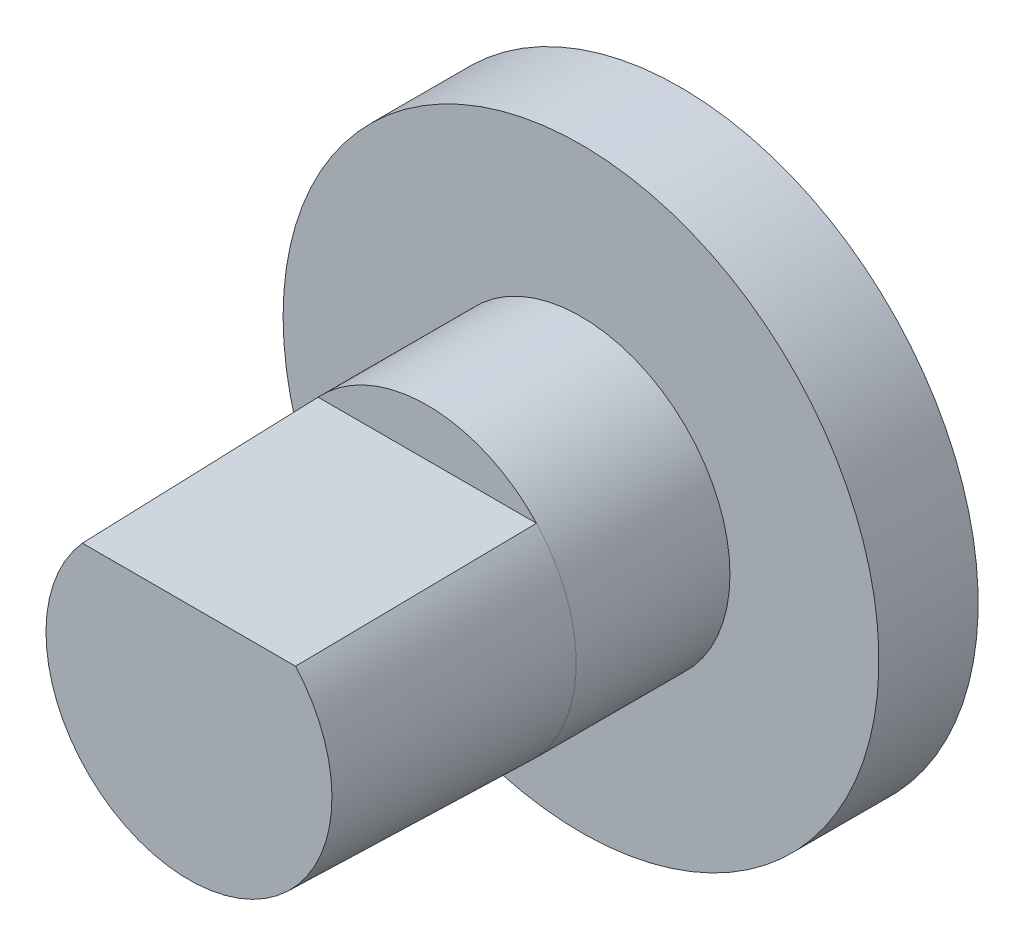
ISO-10303-21;
HEADER;
FILE_DESCRIPTION(('STEP AP214'),'2;1');
FILE_NAME('part.step','',(''),(''),'','','');
FILE_SCHEMA(('AUTOMOTIVE_DESIGN { 1 0 10303 214 1 1 1 1 }'));
ENDSEC;
DATA;
#1=APPLICATION_CONTEXT('core data for automotive mechanical design processes');
#2=APPLICATION_PROTOCOL_DEFINITION('international standard','automotive_design',2000,#1);
#3=PRODUCT_CONTEXT('',#1,'mechanical');
#4=PRODUCT('Part','Part','',(#3));
#5=PRODUCT_RELATED_PRODUCT_CATEGORY('part','',(#4));
#6=PRODUCT_DEFINITION_FORMATION('','',#4);
#7=PRODUCT_DEFINITION_CONTEXT('part definition',#1,'design');
#8=PRODUCT_DEFINITION('design','',#6,#7);
#9=PRODUCT_DEFINITION_SHAPE('','',#8);
#10=(LENGTH_UNIT() NAMED_UNIT(*) SI_UNIT(.MILLI.,.METRE.));
#11=(NAMED_UNIT(*) PLANE_ANGLE_UNIT() SI_UNIT($,.RADIAN.));
#12=(NAMED_UNIT(*) SI_UNIT($,.STERADIAN.) SOLID_ANGLE_UNIT());
#13=UNCERTAINTY_MEASURE_WITH_UNIT(LENGTH_MEASURE(1.E-05),#10,'distance_accuracy_value','');
#14=(GEOMETRIC_REPRESENTATION_CONTEXT(3) GLOBAL_UNCERTAINTY_ASSIGNED_CONTEXT((#13)) GLOBAL_UNIT_ASSIGNED_CONTEXT((#10,
#11,#12)) REPRESENTATION_CONTEXT('',''));
#15=CARTESIAN_POINT('',(0.,0.,0.));
#16=DIRECTION('',(0.,0.,1.));
#17=DIRECTION('',(1.,0.,0.));
#18=AXIS2_PLACEMENT_3D('',#15,#16,#17);
#19=CARTESIAN_POINT('',(0.,0.,19.74));
#20=DIRECTION('',(0.,0.,-1.));
#21=DIRECTION('',(-1.,0.,0.));
#22=AXIS2_PLACEMENT_3D('',#19,#20,#21);
#23=CYLINDRICAL_SURFACE('',#22,7.50000000000001);
#24=CARTESIAN_POINT('',(0.,0.,0.));
#25=DIRECTION('',(0.,0.,1.));
#26=DIRECTION('',(1.,0.,0.));
#27=AXIS2_PLACEMENT_3D('',#24,#25,#26);
#28=CIRCLE('',#27,7.50000000000001);
#29=CARTESIAN_POINT('',(7.50000000000001,0.,0.));
#30=VERTEX_POINT('',#29);
#31=EDGE_CURVE('E12',#30,#30,#28,.T.);
#32=ORIENTED_EDGE('',*,*,#31,.T.);
#33=EDGE_LOOP('',(#32));
#34=FACE_BOUND('',#33,.T.);
#35=CARTESIAN_POINT('',(0.,0.,7.74));
#36=DIRECTION('',(0.,0.,-1.));
#37=DIRECTION('',(1.,0.,0.));
#38=AXIS2_PLACEMENT_3D('',#35,#36,#37);
#39=CIRCLE('',#38,7.50000000000001);
#40=CARTESIAN_POINT('',(-5.49909083394702,5.10000000000163,7.74));
#41=VERTEX_POINT('',#40);
#42=CARTESIAN_POINT('',(5.4990908339455,5.10000000000163,7.74));
#43=VERTEX_POINT('',#42);
#44=EDGE_CURVE('E114',#41,#43,#39,.F.);
#45=ORIENTED_EDGE('',*,*,#44,.F.);
#46=CARTESIAN_POINT('',(0.,0.,7.74));
#47=DIRECTION('',(0.,0.,1.));
#48=DIRECTION('',(1.,0.,0.));
#49=AXIS2_PLACEMENT_3D('',#46,#47,#48);
#50=CIRCLE('',#49,7.50000000000001);
#51=EDGE_CURVE('E158',#43,#41,#50,.T.);
#52=ORIENTED_EDGE('',*,*,#51,.F.);
#53=EDGE_LOOP('',(#45,#52));
#54=FACE_BOUND('',#53,.T.);
#55=ADVANCED_FACE('F88',(#34,#54),#23,.T.);
#56=CARTESIAN_POINT('',(0.,0.,-5.));
#57=DIRECTION('',(0.,0.,1.));
#58=DIRECTION('',(1.,0.,0.));
#59=AXIS2_PLACEMENT_3D('',#56,#57,#58);
#60=CYLINDRICAL_SURFACE('',#59,15.);
#61=CARTESIAN_POINT('',(0.,0.,-5.));
#62=DIRECTION('',(0.,0.,-1.));
#63=DIRECTION('',(-1.,0.,0.));
#64=AXIS2_PLACEMENT_3D('',#61,#62,#63);
#65=CIRCLE('',#64,15.);
#66=CARTESIAN_POINT('',(-15.,0.,-5.));
#67=VERTEX_POINT('',#66);
#68=EDGE_CURVE('E99',#67,#67,#65,.T.);
#69=ORIENTED_EDGE('',*,*,#68,.F.);
#70=EDGE_LOOP('',(#69));
#71=FACE_BOUND('',#70,.T.);
#72=CARTESIAN_POINT('',(0.,0.,0.));
#73=DIRECTION('',(0.,0.,-1.));
#74=DIRECTION('',(-1.,0.,0.));
#75=AXIS2_PLACEMENT_3D('',#72,#73,#74);
#76=CIRCLE('',#75,15.);
#77=CARTESIAN_POINT('',(-15.,0.,0.));
#78=VERTEX_POINT('',#77);
#79=EDGE_CURVE('E155',#78,#78,#76,.T.);
#80=ORIENTED_EDGE('',*,*,#79,.T.);
#81=EDGE_LOOP('',(#80));
#82=FACE_BOUND('',#81,.T.);
#83=ADVANCED_FACE('F172',(#71,#82),#60,.T.);
#84=CARTESIAN_POINT('',(0.,0.,-5.));
#85=DIRECTION('',(0.,0.,-1.));
#86=DIRECTION('',(-1.,0.,0.));
#87=AXIS2_PLACEMENT_3D('',#84,#85,#86);
#88=PLANE('',#87);
#89=ORIENTED_EDGE('',*,*,#68,.T.);
#90=EDGE_LOOP('',(#89));
#91=FACE_BOUND('',#90,.T.);
#92=ADVANCED_FACE('F175',(#91),#88,.T.);
#93=CARTESIAN_POINT('',(0.,0.,0.));
#94=DIRECTION('',(0.,0.,-1.));
#95=DIRECTION('',(-1.,0.,0.));
#96=AXIS2_PLACEMENT_3D('',#93,#94,#95);
#97=PLANE('',#96);
#98=ORIENTED_EDGE('',*,*,#31,.F.);
#99=EDGE_LOOP('',(#98));
#100=FACE_BOUND('',#99,.T.);
#101=ORIENTED_EDGE('',*,*,#79,.F.);
#102=EDGE_LOOP('',(#101));
#103=FACE_BOUND('',#102,.T.);
#104=ADVANCED_FACE('F177',(#100,#103),#97,.F.);
#105=CARTESIAN_POINT('',(0.,0.,7.74));
#106=DIRECTION('',(0.,0.,1.));
#107=DIRECTION('',(1.,0.,0.));
#108=AXIS2_PLACEMENT_3D('',#105,#106,#107);
#109=PLANE('',#108);
#110=DIRECTION('',(-1.,0.,0.));
#111=VECTOR('',#110,1.);
#112=CARTESIAN_POINT('',(0.,5.1,7.74));
#113=LINE('',#112,#111);
#114=EDGE_CURVE('E125',#43,#41,#113,.T.);
#115=ORIENTED_EDGE('',*,*,#114,.F.);
#116=ORIENTED_EDGE('',*,*,#51,.T.);
#117=EDGE_LOOP('',(#115,#116));
#118=FACE_BOUND('',#117,.T.);
#119=ADVANCED_FACE('F180',(#118),#109,.T.);
#120=CARTESIAN_POINT('',(5.4990908339455,5.10000000000163,7.74));
#121=DIRECTION('',(-1.4861240108261E-13,0.999687646408123,0.0249921911602031));
#122=DIRECTION('',(-1.,-1.4865883520375E-13,0.));
#123=AXIS2_PLACEMENT_3D('',#120,#121,#122);
#124=PLANE('',#123);
#125=ORIENTED_EDGE('',*,*,#114,.T.);
#126=DIRECTION('',(0.0110398515498868,-0.0249906681106294,0.999626724425243));
#127=VECTOR('',#126,1.);
#128=CARTESIAN_POINT('',(-5.43282698997325,4.95000000000001,13.74));
#129=LINE('',#128,#127);
#130=CARTESIAN_POINT('',(-5.36656314599949,4.80000000000002,19.74));
#131=VERTEX_POINT('',#130);
#132=EDGE_CURVE('E120',#41,#131,#129,.T.);
#133=ORIENTED_EDGE('',*,*,#132,.T.);
#134=DIRECTION('',(-1.,-1.48612640228592E-13,0.));
#135=VECTOR('',#134,1.);
#136=CARTESIAN_POINT('',(-7.11236625150491E-13,4.80000000000082,19.74));
#137=LINE('',#136,#135);
#138=CARTESIAN_POINT('',(5.36656314599806,4.80000000000161,19.74));
#139=VERTEX_POINT('',#138);
#140=EDGE_CURVE('E107',#139,#131,#137,.T.);
#141=ORIENTED_EDGE('',*,*,#140,.F.);
#142=DIRECTION('',(-0.0110398515498792,-0.0249906681106328,0.999626724425243));
#143=VECTOR('',#142,1.);
#144=CARTESIAN_POINT('',(5.43282698997178,4.95000000000162,13.74));
#145=LINE('',#144,#143);
#146=EDGE_CURVE('E132',#43,#139,#145,.T.);
#147=ORIENTED_EDGE('',*,*,#146,.F.);
#148=EDGE_LOOP('',(#125,#133,#141,#147));
#149=FACE_BOUND('',#148,.T.);
#150=ADVANCED_FACE('F123',(#149),#124,.T.);
#151=CARTESIAN_POINT('',(-2.127570079712,8.74446599952666,7.39582559176756));
#152=CARTESIAN_POINT('',(-2.13016023693432,8.73255987573259,7.74));
#153=CARTESIAN_POINT('',(-2.22046877215481,8.31744044177318,19.74));
#154=CARTESIAN_POINT('',(-3.25267734886183,7.53251211975304,7.39582559176756));
#155=CARTESIAN_POINT('',(-3.25313710260522,7.52170658382173,7.74));
#156=CARTESIAN_POINT('',(-3.2691668967697,7.14496029451546,19.74));
#157=CARTESIAN_POINT('',(-4.37778461801167,6.32055823997942,7.39582559176756));
#158=CARTESIAN_POINT('',(-4.37611396827612,6.31085329191086,7.74));
#159=CARTESIAN_POINT('',(-4.31786502138459,5.97248014725774,19.74));
#160=CARTESIAN_POINT('',(-5.5028918871615,5.10860436020581,7.39582559176756));
#161=CARTESIAN_POINT('',(-5.49909083394702,5.1,7.74));
#162=CARTESIAN_POINT('',(-5.36656314599949,4.80000000000002,19.74));
#163=CARTESIAN_POINT('',(-5.99652035762379,4.57687289215161,7.39582559176756));
#164=CARTESIAN_POINT('',(-5.9917846132562,4.56875140279572,7.74));
#165=CARTESIAN_POINT('',(-5.82666794260389,4.28558719900944,19.74));
#166=CARTESIAN_POINT('',(-6.82859235499994,3.36947596971393,7.39582559176756));
#167=CARTESIAN_POINT('',(-6.82216224896969,3.36262282796011,7.74));
#168=CARTESIAN_POINT('',(-6.59796989033583,3.12368088724977,19.74));
#169=CARTESIAN_POINT('',(-7.50674426489554,1.2769393740516,7.39582559176755));
#170=CARTESIAN_POINT('',(-7.49855168097831,1.27267646336441,7.73999999999999));
#171=CARTESIAN_POINT('',(-7.21290869110099,1.12404563253388,19.74));
#172=CARTESIAN_POINT('',(-7.55857182195293,-0.922021349323758,7.39582559176757));
#173=CARTESIAN_POINT('',(-7.54956576963345,-0.923297549840858,7.74000000000001));
#174=CARTESIAN_POINT('',(-7.23556035479511,-0.967793612996298,19.74));
#175=CARTESIAN_POINT('',(-6.97963564045387,-3.04411318714331,7.39582559176755));
#176=CARTESIAN_POINT('',(-6.97083364508274,-3.0423316534939,7.73999999999999));
#177=CARTESIAN_POINT('',(-6.66394288874795,-2.98021662320267,19.74));
#178=CARTESIAN_POINT('',(-5.81830395674712,-4.91215014478082,7.39582559176755));
#179=CARTESIAN_POINT('',(-5.8106856508377,-4.90756921231279,7.73999999999999));
#180=CARTESIAN_POINT('',(-5.54506546314717,-4.7478502201347,19.74));
#181=CARTESIAN_POINT('',(-4.17145697844474,-6.37030621696409,7.39582559176758));
#182=CARTESIAN_POINT('',(-4.16586182566873,-6.36348299011445,7.74000000000002));
#183=CARTESIAN_POINT('',(-3.97078098378679,-6.12558406376447,19.7399999999999));
#184=CARTESIAN_POINT('',(-2.1765339373372,-7.29688397804109,7.39582559176754));
#185=CARTESIAN_POINT('',(-2.17357505690027,-7.2886126588541,7.73999999999997));
#186=CARTESIAN_POINT('',(-2.07041060192092,-7.00022448161077,19.74));
#187=CARTESIAN_POINT('',(1.12744382079131E-12,-7.61457527198674,7.39582559176758));
#188=CARTESIAN_POINT('',(1.12648605721244E-12,-7.60580455308049,7.74000000000002));
#189=CARTESIAN_POINT('',(1.09309263029989E-12,-7.30000428334072,19.74));
#190=CARTESIAN_POINT('',(2.17653393733936,-7.29688397804044,7.39582559176753));
#191=CARTESIAN_POINT('',(2.17357505690243,-7.28861265885345,7.73999999999997));
#192=CARTESIAN_POINT('',(2.07041060192302,-7.00022448161016,19.7399999999999));
#193=CARTESIAN_POINT('',(4.17145697844664,-6.37030621696285,7.39582559176758));
#194=CARTESIAN_POINT('',(4.16586182567062,-6.36348299011321,7.74000000000001));
#195=CARTESIAN_POINT('',(3.97078098378862,-6.12558406376327,19.74));
#196=CARTESIAN_POINT('',(5.81830395674858,-4.91215014477908,7.39582559176755));
#197=CARTESIAN_POINT('',(5.81068565083917,-4.90756921231105,7.73999999999998));
#198=CARTESIAN_POINT('',(5.54506546314859,-4.74785022013306,19.74));
#199=CARTESIAN_POINT('',(6.97963564045476,-3.04411318714123,7.39582559176756));
#200=CARTESIAN_POINT('',(6.97083364508363,-3.04233165349183,7.74));
#201=CARTESIAN_POINT('',(6.66394288874884,-2.98021662320066,19.74));
#202=CARTESIAN_POINT('',(7.55857182195321,-0.92202134932151,7.39582559176756));
#203=CARTESIAN_POINT('',(7.54956576963373,-0.923297549838613,7.74));
#204=CARTESIAN_POINT('',(7.2355603547954,-0.967793612994136,19.74));
#205=CARTESIAN_POINT('',(7.50674426489516,1.27693937405382,7.39582559176756));
#206=CARTESIAN_POINT('',(7.49855168097793,1.27267646336664,7.73999999999999));
#207=CARTESIAN_POINT('',(7.21290869110067,1.12404563253604,19.74));
#208=CARTESIAN_POINT('',(6.82859235499894,3.36947596971596,7.39582559176756));
#209=CARTESIAN_POINT('',(6.82216224896869,3.36262282796214,7.73999999999999));
#210=CARTESIAN_POINT('',(6.59796989033489,3.12368088725175,19.74));
#211=CARTESIAN_POINT('',(5.99652035762243,4.5768728921534,7.39582559176756));
#212=CARTESIAN_POINT('',(5.99178461325484,4.5687514027975,7.74));
#213=CARTESIAN_POINT('',(5.82666794260262,4.28558719901117,19.74));
#214=CARTESIAN_POINT('',(5.50289188715998,5.10860436020744,7.39582559176756));
#215=CARTESIAN_POINT('',(5.4990908339455,5.10000000000163,7.74));
#216=CARTESIAN_POINT('',(5.36656314599806,4.80000000000161,19.74));
#217=CARTESIAN_POINT('',(4.37778461800978,6.32055823998073,7.39582559176756));
#218=CARTESIAN_POINT('',(4.37611396827424,6.31085329191217,7.74));
#219=CARTESIAN_POINT('',(4.31786502138282,5.97248014725902,19.74));
#220=CARTESIAN_POINT('',(3.25267734885958,7.53251211975402,7.39582559176756));
#221=CARTESIAN_POINT('',(3.25313710260297,7.52170658382271,7.74));
#222=CARTESIAN_POINT('',(3.26916689676757,7.14496029451644,19.74));
#223=CARTESIAN_POINT('',(2.12757007970938,8.7444659995273,7.39582559176756));
#224=CARTESIAN_POINT('',(2.1301602369317,8.73255987573324,7.74));
#225=CARTESIAN_POINT('',(2.22046877215233,8.31744044177385,19.74));
#226=B_SPLINE_SURFACE_WITH_KNOTS('',3,1,((#151,#152,#153),(#154,#155,#156),(#157,#158,#159),
(#160,#161,#162),(#163,#164,#165),(#166,#167,#168),(#169,#170,#171),(#172,#173,#174),(#175,#176,
#177),(#178,#179,#180),(#181,#182,#183),(#184,#185,#186),(#187,#188,#189),(#190,#191,#192),
(#193,#194,#195),(#196,#197,#198),(#199,#200,#201),(#202,#203,#204),(#205,#206,#207),(#208,#209,
#210),(#211,#212,#213),(#214,#215,#216),(#217,#218,#219),(#220,#221,#222),(#223,#224,#225)),
.UNSPECIFIED.,.F.,.F.,.F.,(4,3,1,1,1,1,1,1,1,1,1,1,1,1,1,1,1,3,4),(2,1,2),(-0.142453704617179,
0.,0.0625,0.125,0.1875,0.25,0.3125,0.375,0.4375,0.5,0.5625,0.625,0.6875,0.75,0.8125,0.875,
0.9375,1.,1.14245370461718),(-0.0286812006860364,0.,1.),.UNSPECIFIED.);
#227=CARTESIAN_POINT('',(0.,0.,19.74));
#228=DIRECTION('',(0.,0.,-1.));
#229=DIRECTION('',(1.,0.,0.));
#230=AXIS2_PLACEMENT_3D('',#227,#228,#229);
#231=CIRCLE('',#230,7.20000000000001);
#232=EDGE_CURVE('E92',#131,#139,#231,.F.);
#233=ORIENTED_EDGE('',*,*,#44,.T.);
#234=ORIENTED_EDGE('',*,*,#146,.T.);
#235=ORIENTED_EDGE('',*,*,#232,.F.);
#236=ORIENTED_EDGE('',*,*,#132,.F.);
#237=EDGE_LOOP('',(#233,#234,#235,#236));
#238=FACE_BOUND('',#237,.T.);
#239=ADVANCED_FACE('F131',(#238),#226,.T.);
#240=CARTESIAN_POINT('',(0.,0.,19.74));
#241=DIRECTION('',(0.,0.,1.));
#242=DIRECTION('',(1.,0.,0.));
#243=AXIS2_PLACEMENT_3D('',#240,#241,#242);
#244=PLANE('',#243);
#245=ORIENTED_EDGE('',*,*,#232,.T.);
#246=ORIENTED_EDGE('',*,*,#140,.T.);
#247=EDGE_LOOP('',(#245,#246));
#248=FACE_BOUND('',#247,.T.);
#249=ADVANCED_FACE('F139',(#248),#244,.T.);
#250=CLOSED_SHELL('',(#55,#83,#92,#104,#119,#150,#239,#249));
#251=MANIFOLD_SOLID_BREP('B2',#250);
#252=ADVANCED_BREP_SHAPE_REPRESENTATION('',(#18,#251),#14);
#253=SHAPE_DEFINITION_REPRESENTATION(#9,#252);
ENDSEC;
END-ISO-10303-21;
